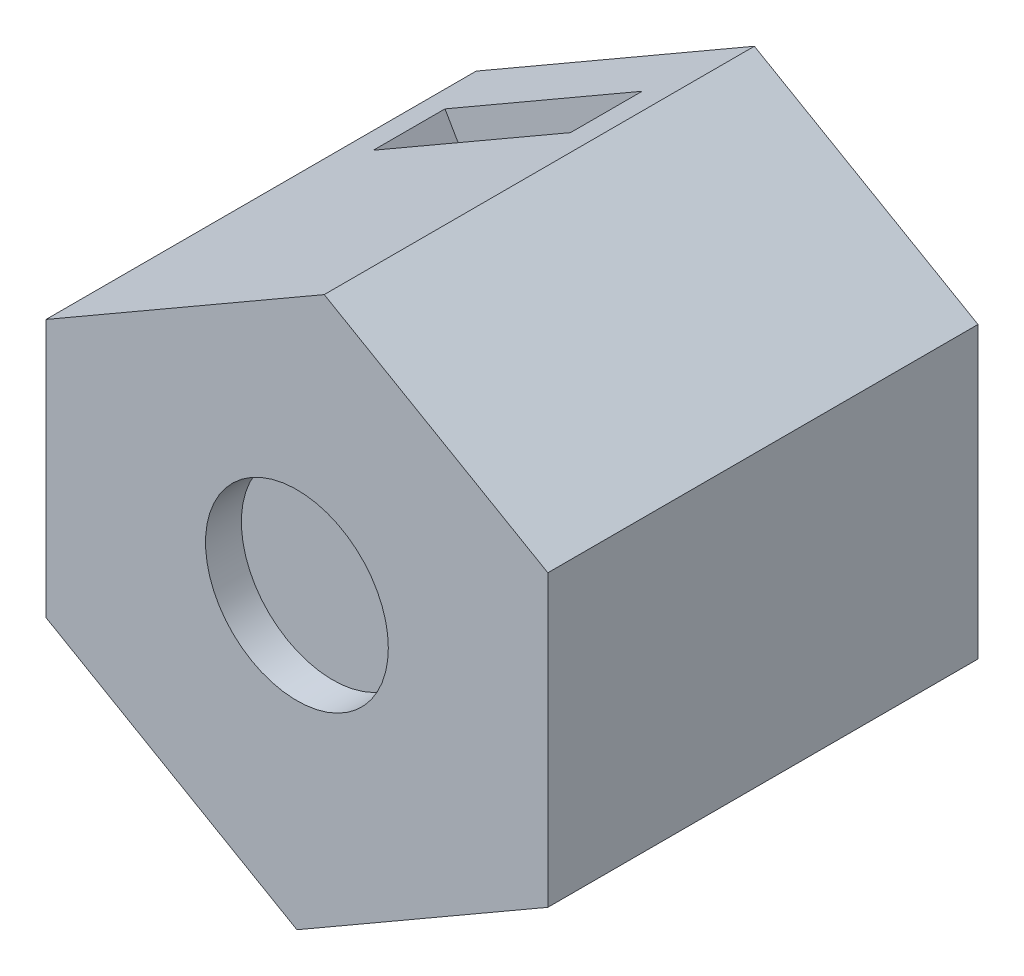
ISO-10303-21;
HEADER;
FILE_DESCRIPTION(('STEP AP214'),'2;1');
FILE_NAME('part.step','',(''),(''),'','','');
FILE_SCHEMA(('AUTOMOTIVE_DESIGN { 1 0 10303 214 1 1 1 1 }'));
ENDSEC;
DATA;
#1=APPLICATION_CONTEXT('core data for automotive mechanical design processes');
#2=APPLICATION_PROTOCOL_DEFINITION('international standard','automotive_design',2000,#1);
#3=PRODUCT_CONTEXT('',#1,'mechanical');
#4=PRODUCT('Part','Part','',(#3));
#5=PRODUCT_RELATED_PRODUCT_CATEGORY('part','',(#4));
#6=PRODUCT_DEFINITION_FORMATION('','',#4);
#7=PRODUCT_DEFINITION_CONTEXT('part definition',#1,'design');
#8=PRODUCT_DEFINITION('design','',#6,#7);
#9=PRODUCT_DEFINITION_SHAPE('','',#8);
#10=(LENGTH_UNIT() NAMED_UNIT(*) SI_UNIT(.MILLI.,.METRE.));
#11=(NAMED_UNIT(*) PLANE_ANGLE_UNIT() SI_UNIT($,.RADIAN.));
#12=(NAMED_UNIT(*) SI_UNIT($,.STERADIAN.) SOLID_ANGLE_UNIT());
#13=UNCERTAINTY_MEASURE_WITH_UNIT(LENGTH_MEASURE(1.E-05),#10,'distance_accuracy_value','');
#14=(GEOMETRIC_REPRESENTATION_CONTEXT(3) GLOBAL_UNCERTAINTY_ASSIGNED_CONTEXT((#13)) GLOBAL_UNIT_ASSIGNED_CONTEXT((#10,
#11,#12)) REPRESENTATION_CONTEXT('',''));
#15=CARTESIAN_POINT('',(0.,0.,0.));
#16=DIRECTION('',(0.,0.,1.));
#17=DIRECTION('',(1.,0.,0.));
#18=AXIS2_PLACEMENT_3D('',#15,#16,#17);
#19=CARTESIAN_POINT('',(0.,0.,12.));
#20=DIRECTION('',(0.,0.,1.));
#21=DIRECTION('',(1.,0.,0.));
#22=AXIS2_PLACEMENT_3D('',#19,#20,#21);
#23=PLANE('',#22);
#24=DIRECTION('',(0.866025403784438,0.5,0.));
#25=VECTOR('',#24,1.);
#26=CARTESIAN_POINT('',(-3.11916121203549,5.40254569624358,12.));
#27=LINE('',#26,#25);
#28=CARTESIAN_POINT('',(-7.,3.16194237733072,12.));
#29=VERTEX_POINT('',#28);
#30=CARTESIAN_POINT('',(0.761677575929034,7.64314901515643,12.));
#31=VERTEX_POINT('',#30);
#32=EDGE_CURVE('E167',#29,#31,#27,.T.);
#33=ORIENTED_EDGE('',*,*,#32,.F.);
#34=DIRECTION('',(0.,-1.,0.));
#35=VECTOR('',#34,1.);
#36=CARTESIAN_POINT('',(-7.,0.,12.));
#37=LINE('',#36,#35);
#38=CARTESIAN_POINT('',(-6.99999999999999,-4.04145188432738,12.));
#39=VERTEX_POINT('',#38);
#40=EDGE_CURVE('E172',#29,#39,#37,.T.);
#41=ORIENTED_EDGE('',*,*,#40,.T.);
#42=DIRECTION('',(0.866025403784439,-0.499999999999999,0.));
#43=VECTOR('',#42,1.);
#44=CARTESIAN_POINT('',(-3.49999999999999,-6.06217782649107,12.));
#45=LINE('',#44,#43);
#46=CARTESIAN_POINT('',(0.,-8.08290376865476,12.));
#47=VERTEX_POINT('',#46);
#48=EDGE_CURVE('E334',#39,#47,#45,.T.);
#49=ORIENTED_EDGE('',*,*,#48,.T.);
#50=DIRECTION('',(0.866025403784438,0.5,0.));
#51=VECTOR('',#50,1.);
#52=CARTESIAN_POINT('',(3.5,-6.06217782649107,12.));
#53=LINE('',#52,#51);
#54=CARTESIAN_POINT('',(7.,-4.04145188432738,12.));
#55=VERTEX_POINT('',#54);
#56=EDGE_CURVE('E345',#47,#55,#53,.T.);
#57=ORIENTED_EDGE('',*,*,#56,.T.);
#58=DIRECTION('',(0.,1.,0.));
#59=VECTOR('',#58,1.);
#60=CARTESIAN_POINT('',(6.99999999999999,0.,12.));
#61=LINE('',#60,#59);
#62=CARTESIAN_POINT('',(6.99999999999999,4.04145188432739,12.));
#63=VERTEX_POINT('',#62);
#64=EDGE_CURVE('E356',#55,#63,#61,.T.);
#65=ORIENTED_EDGE('',*,*,#64,.T.);
#66=DIRECTION('',(-0.866025403784439,0.499999999999999,0.));
#67=VECTOR('',#66,1.);
#68=CARTESIAN_POINT('',(3.49999999999999,6.06217782649107,12.));
#69=LINE('',#68,#67);
#70=EDGE_CURVE('E175',#63,#31,#69,.T.);
#71=ORIENTED_EDGE('',*,*,#70,.T.);
#72=EDGE_LOOP('',(#33,#41,#49,#57,#65,#71));
#73=FACE_BOUND('',#72,.T.);
#74=CARTESIAN_POINT('',(0.,0.,12.));
#75=DIRECTION('',(0.,0.,1.));
#76=DIRECTION('',(1.,0.,0.));
#77=AXIS2_PLACEMENT_3D('',#74,#75,#76);
#78=CIRCLE('',#77,2.55);
#79=CARTESIAN_POINT('',(2.55,0.,12.));
#80=VERTEX_POINT('',#79);
#81=EDGE_CURVE('E52',#80,#80,#78,.T.);
#82=ORIENTED_EDGE('',*,*,#81,.F.);
#83=EDGE_LOOP('',(#82));
#84=FACE_BOUND('',#83,.T.);
#85=ADVANCED_FACE('F41',(#73,#84),#23,.T.);
#86=CARTESIAN_POINT('',(0.,0.,0.));
#87=DIRECTION('',(0.,0.,1.));
#88=DIRECTION('',(1.,0.,0.));
#89=AXIS2_PLACEMENT_3D('',#86,#87,#88);
#90=PLANE('',#89);
#91=CARTESIAN_POINT('',(0.,0.,0.));
#92=DIRECTION('',(0.,0.,-1.));
#93=DIRECTION('',(-1.,0.,0.));
#94=AXIS2_PLACEMENT_3D('',#91,#92,#93);
#95=CIRCLE('',#94,1.5);
#96=CARTESIAN_POINT('',(-1.5,0.,0.));
#97=VERTEX_POINT('',#96);
#98=EDGE_CURVE('E286',#97,#97,#95,.T.);
#99=ORIENTED_EDGE('',*,*,#98,.F.);
#100=EDGE_LOOP('',(#99));
#101=FACE_BOUND('',#100,.T.);
#102=DIRECTION('',(0.,1.,0.));
#103=VECTOR('',#102,1.);
#104=CARTESIAN_POINT('',(-7.,0.,0.));
#105=LINE('',#104,#103);
#106=CARTESIAN_POINT('',(-6.99999999999999,-4.04145188432739,0.));
#107=VERTEX_POINT('',#106);
#108=CARTESIAN_POINT('',(-7.,3.16194237733072,0.));
#109=VERTEX_POINT('',#108);
#110=EDGE_CURVE('E196',#107,#109,#105,.T.);
#111=ORIENTED_EDGE('',*,*,#110,.T.);
#112=DIRECTION('',(-0.866025403784439,-0.5,0.));
#113=VECTOR('',#112,1.);
#114=CARTESIAN_POINT('',(-3.11916121203549,5.40254569624358,0.));
#115=LINE('',#114,#113);
#116=CARTESIAN_POINT('',(0.761677575929034,7.64314901515643,0.));
#117=VERTEX_POINT('',#116);
#118=EDGE_CURVE('E180',#117,#109,#115,.T.);
#119=ORIENTED_EDGE('',*,*,#118,.F.);
#120=DIRECTION('',(0.866025403784439,-0.499999999999999,0.));
#121=VECTOR('',#120,1.);
#122=CARTESIAN_POINT('',(3.49999999999999,6.06217782649107,0.));
#123=LINE('',#122,#121);
#124=CARTESIAN_POINT('',(6.99999999999999,4.04145188432739,0.));
#125=VERTEX_POINT('',#124);
#126=EDGE_CURVE('E197',#117,#125,#123,.T.);
#127=ORIENTED_EDGE('',*,*,#126,.T.);
#128=DIRECTION('',(0.,-1.,0.));
#129=VECTOR('',#128,1.);
#130=CARTESIAN_POINT('',(6.99999999999999,0.,0.));
#131=LINE('',#130,#129);
#132=CARTESIAN_POINT('',(7.,-4.04145188432738,0.));
#133=VERTEX_POINT('',#132);
#134=EDGE_CURVE('E359',#125,#133,#131,.T.);
#135=ORIENTED_EDGE('',*,*,#134,.T.);
#136=DIRECTION('',(-0.866025403784438,-0.5,0.));
#137=VECTOR('',#136,1.);
#138=CARTESIAN_POINT('',(3.5,-6.06217782649107,0.));
#139=LINE('',#138,#137);
#140=CARTESIAN_POINT('',(0.,-8.08290376865476,0.));
#141=VERTEX_POINT('',#140);
#142=EDGE_CURVE('E349',#133,#141,#139,.T.);
#143=ORIENTED_EDGE('',*,*,#142,.T.);
#144=DIRECTION('',(-0.866025403784439,0.499999999999999,0.));
#145=VECTOR('',#144,1.);
#146=CARTESIAN_POINT('',(-3.49999999999999,-6.06217782649107,0.));
#147=LINE('',#146,#145);
#148=EDGE_CURVE('E337',#141,#107,#147,.T.);
#149=ORIENTED_EDGE('',*,*,#148,.T.);
#150=EDGE_LOOP('',(#111,#119,#127,#135,#143,#149));
#151=FACE_BOUND('',#150,.T.);
#152=ADVANCED_FACE('F43',(#101,#151),#90,.F.);
#153=CARTESIAN_POINT('',(0.,0.,11.));
#154=DIRECTION('',(0.,0.,1.));
#155=DIRECTION('',(1.,0.,0.));
#156=AXIS2_PLACEMENT_3D('',#153,#154,#155);
#157=CYLINDRICAL_SURFACE('',#156,2.55);
#158=CARTESIAN_POINT('',(0.,0.,11.));
#159=DIRECTION('',(0.,0.,1.));
#160=DIRECTION('',(1.,0.,0.));
#161=AXIS2_PLACEMENT_3D('',#158,#159,#160);
#162=CIRCLE('',#161,2.55);
#163=CARTESIAN_POINT('',(2.55,0.,11.));
#164=VERTEX_POINT('',#163);
#165=EDGE_CURVE('E11',#164,#164,#162,.T.);
#166=ORIENTED_EDGE('',*,*,#165,.F.);
#167=EDGE_LOOP('',(#166));
#168=FACE_BOUND('',#167,.T.);
#169=ORIENTED_EDGE('',*,*,#81,.T.);
#170=EDGE_LOOP('',(#169));
#171=FACE_BOUND('',#170,.T.);
#172=ADVANCED_FACE('F394',(#168,#171),#157,.F.);
#173=CARTESIAN_POINT('',(0.,0.,11.));
#174=DIRECTION('',(0.,0.,1.));
#175=DIRECTION('',(1.,0.,0.));
#176=AXIS2_PLACEMENT_3D('',#173,#174,#175);
#177=PLANE('',#176);
#178=ORIENTED_EDGE('',*,*,#165,.T.);
#179=EDGE_LOOP('',(#178));
#180=FACE_BOUND('',#179,.T.);
#181=ADVANCED_FACE('F399',(#180),#177,.T.);
#182=CARTESIAN_POINT('',(0.,0.,4.));
#183=DIRECTION('',(0.,0.,-1.));
#184=DIRECTION('',(-1.,0.,0.));
#185=AXIS2_PLACEMENT_3D('',#182,#183,#184);
#186=CYLINDRICAL_SURFACE('',#185,1.5);
#187=CARTESIAN_POINT('',(0.,0.,2.));
#188=DIRECTION('',(0.,0.,-1.));
#189=DIRECTION('',(-1.,0.,0.));
#190=AXIS2_PLACEMENT_3D('',#187,#188,#189);
#191=CIRCLE('',#190,1.5);
#192=CARTESIAN_POINT('',(-1.5,0.,2.));
#193=VERTEX_POINT('',#192);
#194=EDGE_CURVE('E285',#193,#193,#191,.F.);
#195=ORIENTED_EDGE('',*,*,#194,.T.);
#196=EDGE_LOOP('',(#195));
#197=FACE_BOUND('',#196,.T.);
#198=ORIENTED_EDGE('',*,*,#98,.T.);
#199=EDGE_LOOP('',(#198));
#200=FACE_BOUND('',#199,.T.);
#201=ADVANCED_FACE('F296',(#197,#200),#186,.F.);
#202=CARTESIAN_POINT('',(0.,0.,2.));
#203=DIRECTION('',(0.,0.,-1.));
#204=DIRECTION('',(-1.,0.,0.));
#205=AXIS2_PLACEMENT_3D('',#202,#203,#204);
#206=PLANE('',#205);
#207=ORIENTED_EDGE('',*,*,#194,.F.);
#208=EDGE_LOOP('',(#207));
#209=FACE_BOUND('',#208,.T.);
#210=DIRECTION('',(0.5,-0.866025403784438,0.));
#211=VECTOR('',#210,1.);
#212=CARTESIAN_POINT('',(-1.125,8.29941011960087,2.));
#213=LINE('',#212,#211);
#214=CARTESIAN_POINT('',(-0.369161212035483,6.99025893651505,2.));
#215=VERTEX_POINT('',#214);
#216=CARTESIAN_POINT('',(2.725,1.6310145104607,2.));
#217=VERTEX_POINT('',#216);
#218=EDGE_CURVE('E241',#215,#217,#213,.T.);
#219=ORIENTED_EDGE('',*,*,#218,.F.);
#220=DIRECTION('',(-0.866025403784439,-0.5,0.));
#221=VECTOR('',#220,1.);
#222=CARTESIAN_POINT('',(-3.11916121203549,5.40254569624358,2.));
#223=LINE('',#222,#221);
#224=CARTESIAN_POINT('',(-5.86916121203549,3.8148324559721,2.));
#225=VERTEX_POINT('',#224);
#226=EDGE_CURVE('E308',#215,#225,#223,.T.);
#227=ORIENTED_EDGE('',*,*,#226,.T.);
#228=DIRECTION('',(0.5,-0.866025403784438,0.));
#229=VECTOR('',#228,1.);
#230=CARTESIAN_POINT('',(-6.625,5.12398363905793,2.));
#231=LINE('',#230,#229);
#232=CARTESIAN_POINT('',(-2.775,-1.54441197008225,2.));
#233=VERTEX_POINT('',#232);
#234=EDGE_CURVE('E233',#225,#233,#231,.T.);
#235=ORIENTED_EDGE('',*,*,#234,.T.);
#236=DIRECTION('',(0.866025403784438,0.5,0.));
#237=VECTOR('',#236,1.);
#238=CARTESIAN_POINT('',(-2.775,-1.54441197008225,2.));
#239=LINE('',#238,#237);
#240=CARTESIAN_POINT('',(-2.75,-1.52997821335251,2.));
#241=VERTEX_POINT('',#240);
#242=EDGE_CURVE('E214',#233,#241,#239,.T.);
#243=ORIENTED_EDGE('',*,*,#242,.T.);
#244=DIRECTION('',(0.,1.,0.));
#245=VECTOR('',#244,1.);
#246=CARTESIAN_POINT('',(-2.75,-1.58771324027147,2.));
#247=LINE('',#246,#245);
#248=CARTESIAN_POINT('',(-2.75,-1.58771324027147,2.));
#249=VERTEX_POINT('',#248);
#250=EDGE_CURVE('E257',#249,#241,#247,.T.);
#251=ORIENTED_EDGE('',*,*,#250,.F.);
#252=DIRECTION('',(-0.866025403784439,0.5,0.));
#253=VECTOR('',#252,1.);
#254=CARTESIAN_POINT('',(0.,-3.17542648054294,2.));
#255=LINE('',#254,#253);
#256=CARTESIAN_POINT('',(0.,-3.17542648054294,2.));
#257=VERTEX_POINT('',#256);
#258=EDGE_CURVE('E61',#257,#249,#255,.T.);
#259=ORIENTED_EDGE('',*,*,#258,.F.);
#260=DIRECTION('',(-0.866025403784439,-0.5,0.));
#261=VECTOR('',#260,1.);
#262=CARTESIAN_POINT('',(2.75,-1.58771324027147,2.));
#263=LINE('',#262,#261);
#264=CARTESIAN_POINT('',(2.75,-1.58771324027147,2.));
#265=VERTEX_POINT('',#264);
#266=EDGE_CURVE('E252',#265,#257,#263,.T.);
#267=ORIENTED_EDGE('',*,*,#266,.F.);
#268=DIRECTION('',(0.,-1.,0.));
#269=VECTOR('',#268,1.);
#270=CARTESIAN_POINT('',(2.75,1.58771324027147,2.));
#271=LINE('',#270,#269);
#272=CARTESIAN_POINT('',(2.75,1.58771324027147,2.));
#273=VERTEX_POINT('',#272);
#274=EDGE_CURVE('E248',#273,#265,#271,.T.);
#275=ORIENTED_EDGE('',*,*,#274,.F.);
#276=DIRECTION('',(0.866025403784439,-0.5,0.));
#277=VECTOR('',#276,1.);
#278=CARTESIAN_POINT('',(0.,3.17542648054294,2.));
#279=LINE('',#278,#277);
#280=CARTESIAN_POINT('',(2.7,1.61658075373095,2.));
#281=VERTEX_POINT('',#280);
#282=EDGE_CURVE('E91',#281,#273,#279,.T.);
#283=ORIENTED_EDGE('',*,*,#282,.F.);
#284=EDGE_CURVE('E213',#281,#217,#239,.T.);
#285=ORIENTED_EDGE('',*,*,#284,.T.);
#286=EDGE_LOOP('',(#219,#227,#235,#243,#251,#259,#267,#275,#283,#285));
#287=FACE_BOUND('',#286,.T.);
#288=ADVANCED_FACE('F299',(#209,#287),#206,.F.);
#289=CARTESIAN_POINT('',(0.,3.17542648054294,2.));
#290=DIRECTION('',(-0.5,-0.866025403784439,0.));
#291=DIRECTION('',(0.866025403784439,-0.5,0.));
#292=AXIS2_PLACEMENT_3D('',#289,#290,#291);
#293=PLANE('',#292);
#294=DIRECTION('',(0.,0.,1.));
#295=VECTOR('',#294,1.);
#296=CARTESIAN_POINT('',(2.7,1.61658075373095,2.));
#297=LINE('',#296,#295);
#298=CARTESIAN_POINT('',(2.7,1.61658075373095,4.));
#299=VERTEX_POINT('',#298);
#300=EDGE_CURVE('E230',#281,#299,#297,.T.);
#301=ORIENTED_EDGE('',*,*,#300,.F.);
#302=ORIENTED_EDGE('',*,*,#282,.T.);
#303=DIRECTION('',(0.,0.,1.));
#304=VECTOR('',#303,1.);
#305=CARTESIAN_POINT('',(2.75,1.58771324027147,2.));
#306=LINE('',#305,#304);
#307=CARTESIAN_POINT('',(2.75,1.58771324027147,4.));
#308=VERTEX_POINT('',#307);
#309=EDGE_CURVE('E282',#273,#308,#306,.T.);
#310=ORIENTED_EDGE('',*,*,#309,.T.);
#311=DIRECTION('',(0.866025403784439,-0.5,0.));
#312=VECTOR('',#311,1.);
#313=CARTESIAN_POINT('',(0.,3.17542648054294,4.));
#314=LINE('',#313,#312);
#315=EDGE_CURVE('E237',#299,#308,#314,.T.);
#316=ORIENTED_EDGE('',*,*,#315,.F.);
#317=EDGE_LOOP('',(#301,#302,#310,#316));
#318=FACE_BOUND('',#317,.T.);
#319=ADVANCED_FACE('F302',(#318),#293,.T.);
#320=CARTESIAN_POINT('',(2.75,1.58771324027147,2.));
#321=DIRECTION('',(-1.,0.,0.));
#322=DIRECTION('',(0.,0.,1.));
#323=AXIS2_PLACEMENT_3D('',#320,#321,#322);
#324=PLANE('',#323);
#325=DIRECTION('',(0.,-1.,0.));
#326=VECTOR('',#325,1.);
#327=CARTESIAN_POINT('',(2.75,1.58771324027147,4.));
#328=LINE('',#327,#326);
#329=CARTESIAN_POINT('',(2.75,-1.58771324027147,4.));
#330=VERTEX_POINT('',#329);
#331=EDGE_CURVE('E264',#308,#330,#328,.T.);
#332=ORIENTED_EDGE('',*,*,#331,.F.);
#333=ORIENTED_EDGE('',*,*,#309,.F.);
#334=ORIENTED_EDGE('',*,*,#274,.T.);
#335=DIRECTION('',(0.,0.,1.));
#336=VECTOR('',#335,1.);
#337=CARTESIAN_POINT('',(2.75,-1.58771324027147,2.));
#338=LINE('',#337,#336);
#339=EDGE_CURVE('E278',#265,#330,#338,.T.);
#340=ORIENTED_EDGE('',*,*,#339,.T.);
#341=EDGE_LOOP('',(#332,#333,#334,#340));
#342=FACE_BOUND('',#341,.T.);
#343=ADVANCED_FACE('F413',(#342),#324,.T.);
#344=CARTESIAN_POINT('',(2.75,-1.58771324027147,2.));
#345=DIRECTION('',(-0.5,0.866025403784439,0.));
#346=DIRECTION('',(-0.866025403784439,-0.5,0.));
#347=AXIS2_PLACEMENT_3D('',#344,#345,#346);
#348=PLANE('',#347);
#349=DIRECTION('',(-0.866025403784439,-0.5,0.));
#350=VECTOR('',#349,1.);
#351=CARTESIAN_POINT('',(2.75,-1.58771324027147,4.));
#352=LINE('',#351,#350);
#353=CARTESIAN_POINT('',(0.,-3.17542648054294,4.));
#354=VERTEX_POINT('',#353);
#355=EDGE_CURVE('E79',#330,#354,#352,.T.);
#356=ORIENTED_EDGE('',*,*,#355,.F.);
#357=ORIENTED_EDGE('',*,*,#339,.F.);
#358=ORIENTED_EDGE('',*,*,#266,.T.);
#359=DIRECTION('',(0.,0.,1.));
#360=VECTOR('',#359,1.);
#361=CARTESIAN_POINT('',(0.,-3.17542648054294,2.));
#362=LINE('',#361,#360);
#363=EDGE_CURVE('E275',#257,#354,#362,.T.);
#364=ORIENTED_EDGE('',*,*,#363,.T.);
#365=EDGE_LOOP('',(#356,#357,#358,#364));
#366=FACE_BOUND('',#365,.T.);
#367=ADVANCED_FACE('F416',(#366),#348,.T.);
#368=CARTESIAN_POINT('',(0.,-3.17542648054294,2.));
#369=DIRECTION('',(0.5,0.866025403784439,0.));
#370=DIRECTION('',(-0.866025403784439,0.5,0.));
#371=AXIS2_PLACEMENT_3D('',#368,#369,#370);
#372=PLANE('',#371);
#373=DIRECTION('',(-0.866025403784439,0.5,0.));
#374=VECTOR('',#373,1.);
#375=CARTESIAN_POINT('',(0.,-3.17542648054294,4.));
#376=LINE('',#375,#374);
#377=CARTESIAN_POINT('',(-2.75,-1.58771324027147,4.));
#378=VERTEX_POINT('',#377);
#379=EDGE_CURVE('E84',#354,#378,#376,.T.);
#380=ORIENTED_EDGE('',*,*,#379,.F.);
#381=ORIENTED_EDGE('',*,*,#363,.F.);
#382=ORIENTED_EDGE('',*,*,#258,.T.);
#383=DIRECTION('',(0.,0.,1.));
#384=VECTOR('',#383,1.);
#385=CARTESIAN_POINT('',(-2.75,-1.58771324027147,2.));
#386=LINE('',#385,#384);
#387=EDGE_CURVE('E261',#249,#378,#386,.T.);
#388=ORIENTED_EDGE('',*,*,#387,.T.);
#389=EDGE_LOOP('',(#380,#381,#382,#388));
#390=FACE_BOUND('',#389,.T.);
#391=ADVANCED_FACE('F420',(#390),#372,.T.);
#392=CARTESIAN_POINT('',(-2.75,-1.58771324027147,2.));
#393=DIRECTION('',(1.,0.,0.));
#394=DIRECTION('',(0.,1.,0.));
#395=AXIS2_PLACEMENT_3D('',#392,#393,#394);
#396=PLANE('',#395);
#397=DIRECTION('',(0.,0.,-1.));
#398=VECTOR('',#397,1.);
#399=CARTESIAN_POINT('',(-2.75,-1.52997821335251,2.));
#400=LINE('',#399,#398);
#401=CARTESIAN_POINT('',(-2.75,-1.52997821335251,4.));
#402=VERTEX_POINT('',#401);
#403=EDGE_CURVE('E227',#402,#241,#400,.T.);
#404=ORIENTED_EDGE('',*,*,#403,.F.);
#405=DIRECTION('',(0.,1.,0.));
#406=VECTOR('',#405,1.);
#407=CARTESIAN_POINT('',(-2.75,-1.58771324027147,4.));
#408=LINE('',#407,#406);
#409=EDGE_CURVE('E249',#378,#402,#408,.T.);
#410=ORIENTED_EDGE('',*,*,#409,.F.);
#411=ORIENTED_EDGE('',*,*,#387,.F.);
#412=ORIENTED_EDGE('',*,*,#250,.T.);
#413=EDGE_LOOP('',(#404,#410,#411,#412));
#414=FACE_BOUND('',#413,.T.);
#415=ADVANCED_FACE('F410',(#414),#396,.T.);
#416=CARTESIAN_POINT('',(0.,0.,4.));
#417=DIRECTION('',(0.,0.,-1.));
#418=DIRECTION('',(-1.,0.,0.));
#419=AXIS2_PLACEMENT_3D('',#416,#417,#418);
#420=PLANE('',#419);
#421=DIRECTION('',(-0.866025403784439,-0.5,0.));
#422=VECTOR('',#421,1.);
#423=CARTESIAN_POINT('',(-3.11916121203549,5.40254569624358,4.));
#424=LINE('',#423,#422);
#425=CARTESIAN_POINT('',(-0.369161212035484,6.99025893651505,4.));
#426=VERTEX_POINT('',#425);
#427=CARTESIAN_POINT('',(-5.86916121203549,3.8148324559721,4.));
#428=VERTEX_POINT('',#427);
#429=EDGE_CURVE('E322',#426,#428,#424,.T.);
#430=ORIENTED_EDGE('',*,*,#429,.F.);
#431=DIRECTION('',(0.5,-0.866025403784438,0.));
#432=VECTOR('',#431,1.);
#433=CARTESIAN_POINT('',(-1.125,8.29941011960087,4.));
#434=LINE('',#433,#432);
#435=CARTESIAN_POINT('',(2.725,1.6310145104607,4.));
#436=VERTEX_POINT('',#435);
#437=EDGE_CURVE('E238',#426,#436,#434,.T.);
#438=ORIENTED_EDGE('',*,*,#437,.T.);
#439=DIRECTION('',(-0.866025403784438,-0.5,0.));
#440=VECTOR('',#439,1.);
#441=CARTESIAN_POINT('',(-2.775,-1.54441197008225,4.));
#442=LINE('',#441,#440);
#443=EDGE_CURVE('E223',#436,#299,#442,.T.);
#444=ORIENTED_EDGE('',*,*,#443,.T.);
#445=ORIENTED_EDGE('',*,*,#315,.T.);
#446=ORIENTED_EDGE('',*,*,#331,.T.);
#447=ORIENTED_EDGE('',*,*,#355,.T.);
#448=ORIENTED_EDGE('',*,*,#379,.T.);
#449=ORIENTED_EDGE('',*,*,#409,.T.);
#450=CARTESIAN_POINT('',(-2.775,-1.54441197008225,4.));
#451=VERTEX_POINT('',#450);
#452=EDGE_CURVE('E222',#402,#451,#442,.T.);
#453=ORIENTED_EDGE('',*,*,#452,.T.);
#454=DIRECTION('',(0.5,-0.866025403784438,0.));
#455=VECTOR('',#454,1.);
#456=CARTESIAN_POINT('',(-6.625,5.12398363905793,4.));
#457=LINE('',#456,#455);
#458=EDGE_CURVE('E234',#428,#451,#457,.T.);
#459=ORIENTED_EDGE('',*,*,#458,.F.);
#460=EDGE_LOOP('',(#430,#438,#444,#445,#446,#447,#448,#449,#453,#459));
#461=FACE_BOUND('',#460,.T.);
#462=CARTESIAN_POINT('',(0.,0.,4.));
#463=DIRECTION('',(0.,0.,-1.));
#464=DIRECTION('',(-1.,0.,0.));
#465=AXIS2_PLACEMENT_3D('',#462,#463,#464);
#466=CIRCLE('',#465,1.5);
#467=CARTESIAN_POINT('',(-1.5,0.,4.));
#468=VERTEX_POINT('',#467);
#469=EDGE_CURVE('E45',#468,#468,#466,.T.);
#470=ORIENTED_EDGE('',*,*,#469,.F.);
#471=EDGE_LOOP('',(#470));
#472=FACE_BOUND('',#471,.T.);
#473=ADVANCED_FACE('F406',(#461,#472),#420,.T.);
#474=CARTESIAN_POINT('',(-6.625,5.12398363905793,4.));
#475=DIRECTION('',(-0.866025403784438,-0.5,0.));
#476=DIRECTION('',(0.5,-0.866025403784438,0.));
#477=AXIS2_PLACEMENT_3D('',#474,#475,#476);
#478=PLANE('',#477);
#479=ORIENTED_EDGE('',*,*,#234,.F.);
#480=DIRECTION('',(0.,0.,1.));
#481=VECTOR('',#480,1.);
#482=CARTESIAN_POINT('',(-5.86916121203549,3.8148324559721,-1.86521897448216));
#483=LINE('',#482,#481);
#484=EDGE_CURVE('E181',#225,#428,#483,.T.);
#485=ORIENTED_EDGE('',*,*,#484,.T.);
#486=ORIENTED_EDGE('',*,*,#458,.T.);
#487=DIRECTION('',(0.,0.,-1.));
#488=VECTOR('',#487,1.);
#489=CARTESIAN_POINT('',(-2.775,-1.54441197008225,4.));
#490=LINE('',#489,#488);
#491=EDGE_CURVE('E209',#451,#233,#490,.T.);
#492=ORIENTED_EDGE('',*,*,#491,.T.);
#493=EDGE_LOOP('',(#479,#485,#486,#492));
#494=FACE_BOUND('',#493,.T.);
#495=ADVANCED_FACE('F409',(#494),#478,.F.);
#496=CARTESIAN_POINT('',(-1.125,8.29941011960087,4.));
#497=DIRECTION('',(0.866025403784438,0.5,0.));
#498=DIRECTION('',(-0.5,0.866025403784438,0.));
#499=AXIS2_PLACEMENT_3D('',#496,#497,#498);
#500=PLANE('',#499);
#501=ORIENTED_EDGE('',*,*,#437,.F.);
#502=DIRECTION('',(0.,0.,1.));
#503=VECTOR('',#502,1.);
#504=CARTESIAN_POINT('',(-0.369161212035483,6.99025893651505,-1.86521897448216));
#505=LINE('',#504,#503);
#506=EDGE_CURVE('E315',#215,#426,#505,.T.);
#507=ORIENTED_EDGE('',*,*,#506,.F.);
#508=ORIENTED_EDGE('',*,*,#218,.T.);
#509=DIRECTION('',(0.,0.,1.));
#510=VECTOR('',#509,1.);
#511=CARTESIAN_POINT('',(2.725,1.6310145104607,4.));
#512=LINE('',#511,#510);
#513=EDGE_CURVE('E218',#217,#436,#512,.T.);
#514=ORIENTED_EDGE('',*,*,#513,.T.);
#515=EDGE_LOOP('',(#501,#507,#508,#514));
#516=FACE_BOUND('',#515,.T.);
#517=ADVANCED_FACE('F313',(#516),#500,.F.);
#518=CARTESIAN_POINT('',(-0.0250000000000007,0.0433012701892234,0.));
#519=DIRECTION('',(0.5,-0.866025403784439,0.));
#520=DIRECTION('',(0.866025403784438,0.5,0.));
#521=AXIS2_PLACEMENT_3D('',#518,#519,#520);
#522=PLANE('',#521);
#523=ORIENTED_EDGE('',*,*,#300,.T.);
#524=ORIENTED_EDGE('',*,*,#443,.F.);
#525=ORIENTED_EDGE('',*,*,#513,.F.);
#526=ORIENTED_EDGE('',*,*,#284,.F.);
#527=EDGE_LOOP('',(#523,#524,#525,#526));
#528=FACE_BOUND('',#527,.T.);
#529=ADVANCED_FACE('F432',(#528),#522,.F.);
#530=ORIENTED_EDGE('',*,*,#403,.T.);
#531=ORIENTED_EDGE('',*,*,#242,.F.);
#532=ORIENTED_EDGE('',*,*,#491,.F.);
#533=ORIENTED_EDGE('',*,*,#452,.F.);
#534=EDGE_LOOP('',(#530,#531,#532,#533));
#535=FACE_BOUND('',#534,.T.);
#536=ADVANCED_FACE('F433',(#535),#522,.F.);
#537=CARTESIAN_POINT('',(0.,0.,7.));
#538=DIRECTION('',(0.,0.,-1.));
#539=DIRECTION('',(-1.,0.,0.));
#540=AXIS2_PLACEMENT_3D('',#537,#538,#539);
#541=CYLINDRICAL_SURFACE('',#540,1.5);
#542=ORIENTED_EDGE('',*,*,#469,.T.);
#543=EDGE_LOOP('',(#542));
#544=FACE_BOUND('',#543,.T.);
#545=CARTESIAN_POINT('',(0.,0.,7.));
#546=DIRECTION('',(0.,0.,-1.));
#547=DIRECTION('',(-1.,0.,0.));
#548=AXIS2_PLACEMENT_3D('',#545,#546,#547);
#549=CIRCLE('',#548,1.5);
#550=CARTESIAN_POINT('',(-1.5,0.,7.));
#551=VERTEX_POINT('',#550);
#552=EDGE_CURVE('E201',#551,#551,#549,.T.);
#553=ORIENTED_EDGE('',*,*,#552,.F.);
#554=EDGE_LOOP('',(#553));
#555=FACE_BOUND('',#554,.T.);
#556=ADVANCED_FACE('F436',(#544,#555),#541,.F.);
#557=CARTESIAN_POINT('',(0.,0.,7.));
#558=DIRECTION('',(0.,0.,-1.));
#559=DIRECTION('',(-1.,0.,0.));
#560=AXIS2_PLACEMENT_3D('',#557,#558,#559);
#561=PLANE('',#560);
#562=ORIENTED_EDGE('',*,*,#552,.T.);
#563=EDGE_LOOP('',(#562));
#564=FACE_BOUND('',#563,.T.);
#565=ADVANCED_FACE('F388',(#564),#561,.T.);
#566=CARTESIAN_POINT('',(-7.,0.,-7.28583099813146));
#567=DIRECTION('',(-1.,0.,0.));
#568=DIRECTION('',(0.,-1.,0.));
#569=AXIS2_PLACEMENT_3D('',#566,#567,#568);
#570=PLANE('',#569);
#571=DIRECTION('',(0.,0.,1.));
#572=VECTOR('',#571,1.);
#573=CARTESIAN_POINT('',(-7.,3.16194237733072,-1.86521897448216));
#574=LINE('',#573,#572);
#575=EDGE_CURVE('E184',#109,#29,#574,.T.);
#576=ORIENTED_EDGE('',*,*,#575,.F.);
#577=ORIENTED_EDGE('',*,*,#110,.F.);
#578=DIRECTION('',(0.,0.,1.));
#579=VECTOR('',#578,1.);
#580=CARTESIAN_POINT('',(-6.99999999999999,-4.04145188432738,-7.28583099813146));
#581=LINE('',#580,#579);
#582=EDGE_CURVE('E194',#107,#39,#581,.T.);
#583=ORIENTED_EDGE('',*,*,#582,.T.);
#584=ORIENTED_EDGE('',*,*,#40,.F.);
#585=EDGE_LOOP('',(#576,#577,#583,#584));
#586=FACE_BOUND('',#585,.T.);
#587=ADVANCED_FACE('F192',(#586),#570,.T.);
#588=CARTESIAN_POINT('',(3.49999999999999,6.06217782649107,-7.28583099813146));
#589=DIRECTION('',(0.499999999999999,0.866025403784439,0.));
#590=DIRECTION('',(-0.866025403784439,0.499999999999999,0.));
#591=AXIS2_PLACEMENT_3D('',#588,#589,#590);
#592=PLANE('',#591);
#593=DIRECTION('',(0.,0.,1.));
#594=VECTOR('',#593,1.);
#595=CARTESIAN_POINT('',(0.761677575929034,7.64314901515643,-1.86521897448216));
#596=LINE('',#595,#594);
#597=EDGE_CURVE('E189',#117,#31,#596,.T.);
#598=ORIENTED_EDGE('',*,*,#597,.T.);
#599=ORIENTED_EDGE('',*,*,#70,.F.);
#600=DIRECTION('',(0.,0.,1.));
#601=VECTOR('',#600,1.);
#602=CARTESIAN_POINT('',(6.99999999999999,4.04145188432739,-7.28583099813146));
#603=LINE('',#602,#601);
#604=EDGE_CURVE('E352',#125,#63,#603,.T.);
#605=ORIENTED_EDGE('',*,*,#604,.F.);
#606=ORIENTED_EDGE('',*,*,#126,.F.);
#607=EDGE_LOOP('',(#598,#599,#605,#606));
#608=FACE_BOUND('',#607,.T.);
#609=ADVANCED_FACE('F380',(#608),#592,.T.);
#610=CARTESIAN_POINT('',(6.99999999999999,0.,-7.28583099813146));
#611=DIRECTION('',(1.,0.,0.));
#612=DIRECTION('',(0.,1.,0.));
#613=AXIS2_PLACEMENT_3D('',#610,#611,#612);
#614=PLANE('',#613);
#615=ORIENTED_EDGE('',*,*,#134,.F.);
#616=ORIENTED_EDGE('',*,*,#604,.T.);
#617=ORIENTED_EDGE('',*,*,#64,.F.);
#618=DIRECTION('',(0.,0.,1.));
#619=VECTOR('',#618,1.);
#620=CARTESIAN_POINT('',(7.,-4.04145188432738,-7.28583099813146));
#621=LINE('',#620,#619);
#622=EDGE_CURVE('E341',#133,#55,#621,.T.);
#623=ORIENTED_EDGE('',*,*,#622,.F.);
#624=EDGE_LOOP('',(#615,#616,#617,#623));
#625=FACE_BOUND('',#624,.T.);
#626=ADVANCED_FACE('F373',(#625),#614,.T.);
#627=CARTESIAN_POINT('',(3.5,-6.06217782649107,-7.28583099813146));
#628=DIRECTION('',(0.5,-0.866025403784438,0.));
#629=DIRECTION('',(0.866025403784438,0.5,0.));
#630=AXIS2_PLACEMENT_3D('',#627,#628,#629);
#631=PLANE('',#630);
#632=ORIENTED_EDGE('',*,*,#142,.F.);
#633=ORIENTED_EDGE('',*,*,#622,.T.);
#634=ORIENTED_EDGE('',*,*,#56,.F.);
#635=DIRECTION('',(0.,0.,1.));
#636=VECTOR('',#635,1.);
#637=CARTESIAN_POINT('',(0.,-8.08290376865476,-7.28583099813146));
#638=LINE('',#637,#636);
#639=EDGE_CURVE('E326',#141,#47,#638,.T.);
#640=ORIENTED_EDGE('',*,*,#639,.F.);
#641=EDGE_LOOP('',(#632,#633,#634,#640));
#642=FACE_BOUND('',#641,.T.);
#643=ADVANCED_FACE('F372',(#642),#631,.T.);
#644=CARTESIAN_POINT('',(-3.49999999999999,-6.06217782649107,-7.28583099813146));
#645=DIRECTION('',(-0.499999999999999,-0.866025403784439,0.));
#646=DIRECTION('',(0.866025403784439,-0.499999999999999,0.));
#647=AXIS2_PLACEMENT_3D('',#644,#645,#646);
#648=PLANE('',#647);
#649=ORIENTED_EDGE('',*,*,#148,.F.);
#650=ORIENTED_EDGE('',*,*,#639,.T.);
#651=ORIENTED_EDGE('',*,*,#48,.F.);
#652=ORIENTED_EDGE('',*,*,#582,.F.);
#653=EDGE_LOOP('',(#649,#650,#651,#652));
#654=FACE_BOUND('',#653,.T.);
#655=ADVANCED_FACE('F375',(#654),#648,.T.);
#656=CARTESIAN_POINT('',(-3.11916121203549,5.40254569624358,-6.35085296108589));
#657=DIRECTION('',(0.5,-0.866025403784438,0.));
#658=DIRECTION('',(0.866025403784439,0.5,0.));
#659=AXIS2_PLACEMENT_3D('',#656,#657,#658);
#660=PLANE('',#659);
#661=ORIENTED_EDGE('',*,*,#484,.F.);
#662=ORIENTED_EDGE('',*,*,#226,.F.);
#663=ORIENTED_EDGE('',*,*,#506,.T.);
#664=ORIENTED_EDGE('',*,*,#429,.T.);
#665=EDGE_LOOP('',(#661,#662,#663,#664));
#666=FACE_BOUND('',#665,.T.);
#667=ORIENTED_EDGE('',*,*,#118,.T.);
#668=ORIENTED_EDGE('',*,*,#575,.T.);
#669=ORIENTED_EDGE('',*,*,#32,.T.);
#670=ORIENTED_EDGE('',*,*,#597,.F.);
#671=EDGE_LOOP('',(#667,#668,#669,#670));
#672=FACE_BOUND('',#671,.T.);
#673=ADVANCED_FACE('F185',(#666,#672),#660,.F.);
#674=CLOSED_SHELL('',(#85,#152,#172,#181,#201,#288,#319,#343,#367,#391,#415,#473,#495,#517,#529,
#536,#556,#565,#587,#609,#626,#643,#655,#673));
#675=MANIFOLD_SOLID_BREP('B2',#674);
#676=ADVANCED_BREP_SHAPE_REPRESENTATION('',(#18,#675),#14);
#677=SHAPE_DEFINITION_REPRESENTATION(#9,#676);
ENDSEC;
END-ISO-10303-21;
